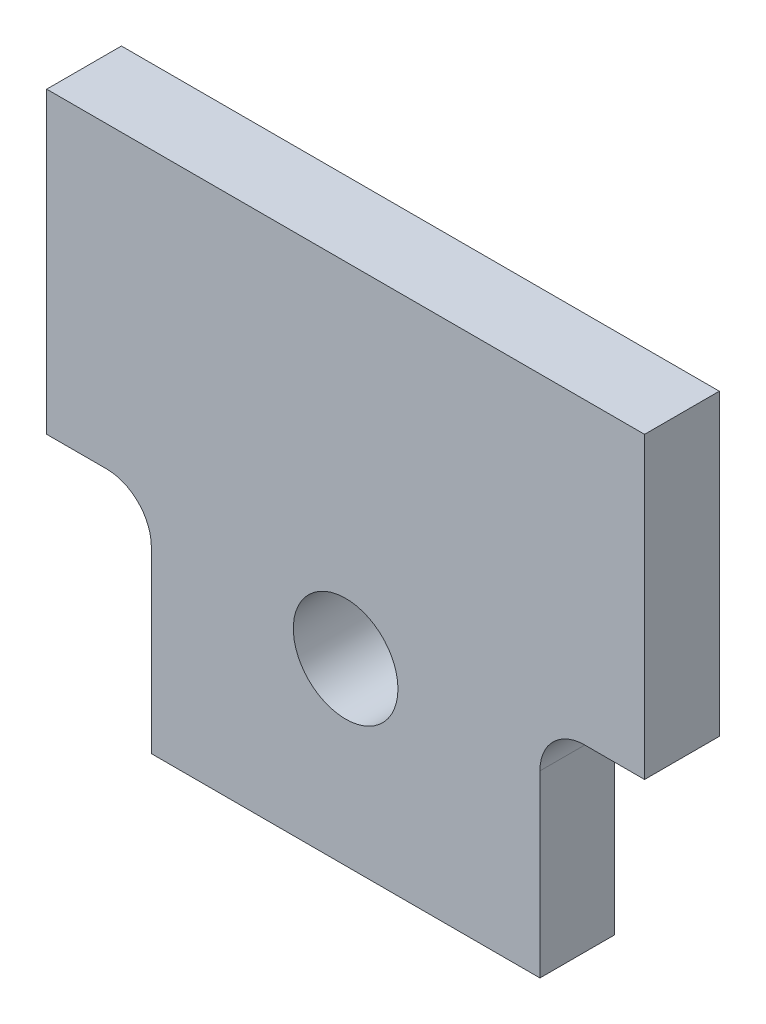
ISO-10303-21;
HEADER;
FILE_DESCRIPTION(('STEP AP214'),'2;1');
FILE_NAME('part.step','',(''),(''),'','','');
FILE_SCHEMA(('AUTOMOTIVE_DESIGN { 1 0 10303 214 1 1 1 1 }'));
ENDSEC;
DATA;
#1=APPLICATION_CONTEXT('core data for automotive mechanical design processes');
#2=APPLICATION_PROTOCOL_DEFINITION('international standard','automotive_design',2000,#1);
#3=PRODUCT_CONTEXT('',#1,'mechanical');
#4=PRODUCT('Part','Part','',(#3));
#5=PRODUCT_RELATED_PRODUCT_CATEGORY('part','',(#4));
#6=PRODUCT_DEFINITION_FORMATION('','',#4);
#7=PRODUCT_DEFINITION_CONTEXT('part definition',#1,'design');
#8=PRODUCT_DEFINITION('design','',#6,#7);
#9=PRODUCT_DEFINITION_SHAPE('','',#8);
#10=(LENGTH_UNIT() NAMED_UNIT(*) SI_UNIT(.MILLI.,.METRE.));
#11=(NAMED_UNIT(*) PLANE_ANGLE_UNIT() SI_UNIT($,.RADIAN.));
#12=(NAMED_UNIT(*) SI_UNIT($,.STERADIAN.) SOLID_ANGLE_UNIT());
#13=UNCERTAINTY_MEASURE_WITH_UNIT(LENGTH_MEASURE(1.E-05),#10,'distance_accuracy_value','');
#14=(GEOMETRIC_REPRESENTATION_CONTEXT(3) GLOBAL_UNCERTAINTY_ASSIGNED_CONTEXT((#13)) GLOBAL_UNIT_ASSIGNED_CONTEXT((#10,
#11,#12)) REPRESENTATION_CONTEXT('',''));
#15=CARTESIAN_POINT('',(0.,0.,0.));
#16=DIRECTION('',(0.,0.,1.));
#17=DIRECTION('',(1.,0.,0.));
#18=AXIS2_PLACEMENT_3D('',#15,#16,#17);
#19=CARTESIAN_POINT('',(-1250.,-390.,19.9963663896532));
#20=DIRECTION('',(-1.,0.,0.));
#21=DIRECTION('',(0.,0.,1.));
#22=AXIS2_PLACEMENT_3D('',#19,#20,#21);
#23=PLANE('',#22);
#24=DIRECTION('',(0.,1.,0.));
#25=VECTOR('',#24,1.);
#26=CARTESIAN_POINT('',(-1250.,-390.,19.9963663896532));
#27=LINE('',#26,#25);
#28=CARTESIAN_POINT('',(-1250.,-375.,19.9963663896576));
#29=VERTEX_POINT('',#28);
#30=CARTESIAN_POINT('',(-1250.,-355.,19.9963663896534));
#31=VERTEX_POINT('',#30);
#32=EDGE_CURVE('E136',#29,#31,#27,.T.);
#33=ORIENTED_EDGE('',*,*,#32,.F.);
#34=DIRECTION('',(0.,0.,1.));
#35=VECTOR('',#34,1.);
#36=CARTESIAN_POINT('',(-1250.,-375.,-20.0036336103399));
#37=LINE('',#36,#35);
#38=CARTESIAN_POINT('',(-1250.,-375.,14.9963663896531));
#39=VERTEX_POINT('',#38);
#40=EDGE_CURVE('E119',#39,#29,#37,.T.);
#41=ORIENTED_EDGE('',*,*,#40,.F.);
#42=DIRECTION('',(0.,1.,0.));
#43=VECTOR('',#42,1.);
#44=CARTESIAN_POINT('',(-1250.,-390.,14.9963663896531));
#45=LINE('',#44,#43);
#46=CARTESIAN_POINT('',(-1250.,-355.,14.9963663896531));
#47=VERTEX_POINT('',#46);
#48=EDGE_CURVE('E196',#39,#47,#45,.T.);
#49=ORIENTED_EDGE('',*,*,#48,.T.);
#50=DIRECTION('',(0.,0.,1.));
#51=VECTOR('',#50,1.);
#52=CARTESIAN_POINT('',(-1250.,-355.,19.9963663896534));
#53=LINE('',#52,#51);
#54=EDGE_CURVE('E144',#47,#31,#53,.T.);
#55=ORIENTED_EDGE('',*,*,#54,.T.);
#56=EDGE_LOOP('',(#33,#41,#49,#55));
#57=FACE_BOUND('',#56,.T.);
#58=ADVANCED_FACE('F42',(#57),#23,.F.);
#59=CARTESIAN_POINT('',(-1250.,-390.,19.9963663896532));
#60=DIRECTION('',(0.,0.,-1.));
#61=DIRECTION('',(-1.,0.,0.));
#62=AXIS2_PLACEMENT_3D('',#59,#60,#61);
#63=PLANE('',#62);
#64=CARTESIAN_POINT('',(-1270.,-378.,19.9963663896575));
#65=DIRECTION('',(0.,0.,1.));
#66=DIRECTION('',(1.,0.,0.));
#67=AXIS2_PLACEMENT_3D('',#64,#65,#66);
#68=CIRCLE('',#67,3.50000000000006);
#69=CARTESIAN_POINT('',(-1266.5,-378.,19.9963663896575));
#70=VERTEX_POINT('',#69);
#71=EDGE_CURVE('E213',#70,#70,#68,.T.);
#72=ORIENTED_EDGE('',*,*,#71,.F.);
#73=EDGE_LOOP('',(#72));
#74=FACE_BOUND('',#73,.T.);
#75=DIRECTION('',(-1.,0.,0.));
#76=VECTOR('',#75,1.);
#77=CARTESIAN_POINT('',(-1250.,-390.,19.9963663896532));
#78=LINE('',#77,#76);
#79=CARTESIAN_POINT('',(-1257.,-390.,19.9963663896531));
#80=VERTEX_POINT('',#79);
#81=CARTESIAN_POINT('',(-1283.,-390.,19.9963663896574));
#82=VERTEX_POINT('',#81);
#83=EDGE_CURVE('E225',#80,#82,#78,.T.);
#84=ORIENTED_EDGE('',*,*,#83,.F.);
#85=DIRECTION('',(0.,-1.,0.));
#86=VECTOR('',#85,1.);
#87=CARTESIAN_POINT('',(-1257.,-390.,19.9963663896576));
#88=LINE('',#87,#86);
#89=CARTESIAN_POINT('',(-1257.,-378.,19.9963663896576));
#90=VERTEX_POINT('',#89);
#91=EDGE_CURVE('E131',#90,#80,#88,.T.);
#92=ORIENTED_EDGE('',*,*,#91,.F.);
#93=CARTESIAN_POINT('',(-1254.,-378.,19.996366389653));
#94=DIRECTION('',(0.,0.,-1.));
#95=DIRECTION('',(-1.,0.,0.));
#96=AXIS2_PLACEMENT_3D('',#93,#94,#95);
#97=CIRCLE('',#96,3.);
#98=CARTESIAN_POINT('',(-1254.,-375.,19.9963663896576));
#99=VERTEX_POINT('',#98);
#100=EDGE_CURVE('E139',#90,#99,#97,.T.);
#101=ORIENTED_EDGE('',*,*,#100,.T.);
#102=DIRECTION('',(-1.,0.,0.));
#103=VECTOR('',#102,1.);
#104=CARTESIAN_POINT('',(-1250.,-375.,19.9963663896576));
#105=LINE('',#104,#103);
#106=EDGE_CURVE('E122',#29,#99,#105,.T.);
#107=ORIENTED_EDGE('',*,*,#106,.F.);
#108=ORIENTED_EDGE('',*,*,#32,.T.);
#109=DIRECTION('',(-1.,0.,0.));
#110=VECTOR('',#109,1.);
#111=CARTESIAN_POINT('',(-1250.,-355.,19.9963663896534));
#112=LINE('',#111,#110);
#113=CARTESIAN_POINT('',(-1290.,-355.,19.996366389653));
#114=VERTEX_POINT('',#113);
#115=EDGE_CURVE('E208',#31,#114,#112,.T.);
#116=ORIENTED_EDGE('',*,*,#115,.T.);
#117=DIRECTION('',(0.,1.,0.));
#118=VECTOR('',#117,1.);
#119=CARTESIAN_POINT('',(-1290.,-390.,19.9963663896531));
#120=LINE('',#119,#118);
#121=CARTESIAN_POINT('',(-1290.,-375.,19.9963663896574));
#122=VERTEX_POINT('',#121);
#123=EDGE_CURVE('E147',#122,#114,#120,.T.);
#124=ORIENTED_EDGE('',*,*,#123,.F.);
#125=DIRECTION('',(-1.,0.,0.));
#126=VECTOR('',#125,1.);
#127=CARTESIAN_POINT('',(-1290.,-375.,19.9963663896574));
#128=LINE('',#127,#126);
#129=CARTESIAN_POINT('',(-1286.,-375.,19.9963663896574));
#130=VERTEX_POINT('',#129);
#131=EDGE_CURVE('E188',#130,#122,#128,.T.);
#132=ORIENTED_EDGE('',*,*,#131,.F.);
#133=CARTESIAN_POINT('',(-1286.,-378.,19.996366389653));
#134=DIRECTION('',(0.,0.,-1.));
#135=DIRECTION('',(-1.,0.,0.));
#136=AXIS2_PLACEMENT_3D('',#133,#134,#135);
#137=CIRCLE('',#136,3.);
#138=CARTESIAN_POINT('',(-1283.,-378.,19.9963663896574));
#139=VERTEX_POINT('',#138);
#140=EDGE_CURVE('E51',#130,#139,#137,.T.);
#141=ORIENTED_EDGE('',*,*,#140,.T.);
#142=DIRECTION('',(0.,1.,0.));
#143=VECTOR('',#142,1.);
#144=CARTESIAN_POINT('',(-1283.,-390.,19.9963663896574));
#145=LINE('',#144,#143);
#146=EDGE_CURVE('E190',#82,#139,#145,.T.);
#147=ORIENTED_EDGE('',*,*,#146,.F.);
#148=EDGE_LOOP('',(#84,#92,#101,#107,#108,#116,#124,#132,#141,#147));
#149=FACE_BOUND('',#148,.T.);
#150=ADVANCED_FACE('F134',(#74,#149),#63,.F.);
#151=CARTESIAN_POINT('',(-1290.,-390.,14.9963663896529));
#152=DIRECTION('',(1.,0.,0.));
#153=DIRECTION('',(0.,0.,-1.));
#154=AXIS2_PLACEMENT_3D('',#151,#152,#153);
#155=PLANE('',#154);
#156=DIRECTION('',(0.,1.,0.));
#157=VECTOR('',#156,1.);
#158=CARTESIAN_POINT('',(-1290.,-390.,14.9963663896529));
#159=LINE('',#158,#157);
#160=CARTESIAN_POINT('',(-1290.,-375.,14.9963663896529));
#161=VERTEX_POINT('',#160);
#162=CARTESIAN_POINT('',(-1290.,-355.,14.9963663896529));
#163=VERTEX_POINT('',#162);
#164=EDGE_CURVE('E155',#161,#163,#159,.T.);
#165=ORIENTED_EDGE('',*,*,#164,.F.);
#166=DIRECTION('',(0.,0.,1.));
#167=VECTOR('',#166,1.);
#168=CARTESIAN_POINT('',(-1290.,-375.,-20.00363361034));
#169=LINE('',#168,#167);
#170=EDGE_CURVE('E197',#161,#122,#169,.T.);
#171=ORIENTED_EDGE('',*,*,#170,.T.);
#172=ORIENTED_EDGE('',*,*,#123,.T.);
#173=DIRECTION('',(0.,0.,-1.));
#174=VECTOR('',#173,1.);
#175=CARTESIAN_POINT('',(-1290.,-355.,14.9963663896529));
#176=LINE('',#175,#174);
#177=EDGE_CURVE('E203',#114,#163,#176,.T.);
#178=ORIENTED_EDGE('',*,*,#177,.T.);
#179=EDGE_LOOP('',(#165,#171,#172,#178));
#180=FACE_BOUND('',#179,.T.);
#181=ADVANCED_FACE('F275',(#180),#155,.F.);
#182=CARTESIAN_POINT('',(-1250.,-390.,14.9963663896531));
#183=DIRECTION('',(0.,0.,1.));
#184=DIRECTION('',(1.,0.,0.));
#185=AXIS2_PLACEMENT_3D('',#182,#183,#184);
#186=PLANE('',#185);
#187=CARTESIAN_POINT('',(-1270.,-378.,14.9963663896528));
#188=DIRECTION('',(0.,0.,1.));
#189=DIRECTION('',(1.,0.,0.));
#190=AXIS2_PLACEMENT_3D('',#187,#188,#189);
#191=CIRCLE('',#190,3.50000000000006);
#192=CARTESIAN_POINT('',(-1266.5,-378.,14.9963663896528));
#193=VERTEX_POINT('',#192);
#194=EDGE_CURVE('E210',#193,#193,#191,.T.);
#195=ORIENTED_EDGE('',*,*,#194,.T.);
#196=EDGE_LOOP('',(#195));
#197=FACE_BOUND('',#196,.T.);
#198=DIRECTION('',(-1.,0.,0.));
#199=VECTOR('',#198,1.);
#200=CARTESIAN_POINT('',(-1250.,-375.,14.9963663896531));
#201=LINE('',#200,#199);
#202=CARTESIAN_POINT('',(-1254.,-375.,14.9963663896529));
#203=VERTEX_POINT('',#202);
#204=EDGE_CURVE('E125',#39,#203,#201,.T.);
#205=ORIENTED_EDGE('',*,*,#204,.T.);
#206=CARTESIAN_POINT('',(-1254.,-378.,14.9963663896532));
#207=DIRECTION('',(0.,0.,1.));
#208=DIRECTION('',(1.,0.,0.));
#209=AXIS2_PLACEMENT_3D('',#206,#207,#208);
#210=CIRCLE('',#209,3.);
#211=CARTESIAN_POINT('',(-1257.,-378.,14.996366389653));
#212=VERTEX_POINT('',#211);
#213=EDGE_CURVE('E182',#203,#212,#210,.T.);
#214=ORIENTED_EDGE('',*,*,#213,.T.);
#215=DIRECTION('',(0.,-1.,0.));
#216=VECTOR('',#215,1.);
#217=CARTESIAN_POINT('',(-1257.,-390.,14.996366389653));
#218=LINE('',#217,#216);
#219=CARTESIAN_POINT('',(-1257.,-390.,14.996366389653));
#220=VERTEX_POINT('',#219);
#221=EDGE_CURVE('E130',#212,#220,#218,.T.);
#222=ORIENTED_EDGE('',*,*,#221,.T.);
#223=DIRECTION('',(1.,0.,0.));
#224=VECTOR('',#223,1.);
#225=CARTESIAN_POINT('',(-1250.,-390.,14.9963663896531));
#226=LINE('',#225,#224);
#227=CARTESIAN_POINT('',(-1283.,-390.,14.9963663896526));
#228=VERTEX_POINT('',#227);
#229=EDGE_CURVE('E221',#228,#220,#226,.T.);
#230=ORIENTED_EDGE('',*,*,#229,.F.);
#231=DIRECTION('',(0.,1.,0.));
#232=VECTOR('',#231,1.);
#233=CARTESIAN_POINT('',(-1283.,-390.,14.9963663896526));
#234=LINE('',#233,#232);
#235=CARTESIAN_POINT('',(-1283.,-378.,14.9963663896529));
#236=VERTEX_POINT('',#235);
#237=EDGE_CURVE('E201',#228,#236,#234,.T.);
#238=ORIENTED_EDGE('',*,*,#237,.T.);
#239=CARTESIAN_POINT('',(-1286.,-378.,14.9963663896528));
#240=DIRECTION('',(0.,0.,1.));
#241=DIRECTION('',(1.,0.,0.));
#242=AXIS2_PLACEMENT_3D('',#239,#240,#241);
#243=CIRCLE('',#242,3.);
#244=CARTESIAN_POINT('',(-1286.,-375.,14.9963663896532));
#245=VERTEX_POINT('',#244);
#246=EDGE_CURVE('E11',#236,#245,#243,.T.);
#247=ORIENTED_EDGE('',*,*,#246,.T.);
#248=DIRECTION('',(-1.,0.,0.));
#249=VECTOR('',#248,1.);
#250=CARTESIAN_POINT('',(-1250.,-375.,14.9963663896531));
#251=LINE('',#250,#249);
#252=EDGE_CURVE('E152',#245,#161,#251,.T.);
#253=ORIENTED_EDGE('',*,*,#252,.T.);
#254=ORIENTED_EDGE('',*,*,#164,.T.);
#255=DIRECTION('',(1.,0.,0.));
#256=VECTOR('',#255,1.);
#257=CARTESIAN_POINT('',(-1250.,-355.,14.9963663896531));
#258=LINE('',#257,#256);
#259=EDGE_CURVE('E207',#163,#47,#258,.T.);
#260=ORIENTED_EDGE('',*,*,#259,.T.);
#261=ORIENTED_EDGE('',*,*,#48,.F.);
#262=EDGE_LOOP('',(#205,#214,#222,#230,#238,#247,#253,#254,#260,#261));
#263=FACE_BOUND('',#262,.T.);
#264=ADVANCED_FACE('F250',(#197,#263),#186,.F.);
#265=CARTESIAN_POINT('',(0.,-390.,0.));
#266=DIRECTION('',(0.,1.,0.));
#267=DIRECTION('',(0.,0.,1.));
#268=AXIS2_PLACEMENT_3D('',#265,#266,#267);
#269=PLANE('',#268);
#270=ORIENTED_EDGE('',*,*,#229,.T.);
#271=DIRECTION('',(0.,0.,1.));
#272=VECTOR('',#271,1.);
#273=CARTESIAN_POINT('',(-1257.,-390.,0.));
#274=LINE('',#273,#272);
#275=EDGE_CURVE('E161',#220,#80,#274,.T.);
#276=ORIENTED_EDGE('',*,*,#275,.T.);
#277=ORIENTED_EDGE('',*,*,#83,.T.);
#278=DIRECTION('',(0.,0.,-1.));
#279=VECTOR('',#278,1.);
#280=CARTESIAN_POINT('',(-1283.,-390.,0.));
#281=LINE('',#280,#279);
#282=EDGE_CURVE('E146',#82,#228,#281,.T.);
#283=ORIENTED_EDGE('',*,*,#282,.T.);
#284=EDGE_LOOP('',(#270,#276,#277,#283));
#285=FACE_BOUND('',#284,.T.);
#286=ADVANCED_FACE('F287',(#285),#269,.F.);
#287=CARTESIAN_POINT('',(-1.11022302462516E-13,-355.,0.));
#288=DIRECTION('',(0.,1.,0.));
#289=DIRECTION('',(0.,0.,1.));
#290=AXIS2_PLACEMENT_3D('',#287,#288,#289);
#291=PLANE('',#290);
#292=ORIENTED_EDGE('',*,*,#54,.F.);
#293=ORIENTED_EDGE('',*,*,#259,.F.);
#294=ORIENTED_EDGE('',*,*,#177,.F.);
#295=ORIENTED_EDGE('',*,*,#115,.F.);
#296=EDGE_LOOP('',(#292,#293,#294,#295));
#297=FACE_BOUND('',#296,.T.);
#298=ADVANCED_FACE('F272',(#297),#291,.T.);
#299=CARTESIAN_POINT('',(-1270.,-378.,19.9963663896575));
#300=DIRECTION('',(0.,0.,1.));
#301=DIRECTION('',(1.,0.,0.));
#302=AXIS2_PLACEMENT_3D('',#299,#300,#301);
#303=CYLINDRICAL_SURFACE('',#302,3.50000000000006);
#304=ORIENTED_EDGE('',*,*,#71,.T.);
#305=EDGE_LOOP('',(#304));
#306=FACE_BOUND('',#305,.T.);
#307=ORIENTED_EDGE('',*,*,#194,.F.);
#308=EDGE_LOOP('',(#307));
#309=FACE_BOUND('',#308,.T.);
#310=ADVANCED_FACE('F294',(#306,#309),#303,.F.);
#311=CARTESIAN_POINT('',(-1290.,-375.,-20.00363361034));
#312=DIRECTION('',(0.,1.,0.));
#313=DIRECTION('',(0.,0.,1.));
#314=AXIS2_PLACEMENT_3D('',#311,#312,#313);
#315=PLANE('',#314);
#316=ORIENTED_EDGE('',*,*,#252,.F.);
#317=DIRECTION('',(0.,0.,1.));
#318=VECTOR('',#317,1.);
#319=CARTESIAN_POINT('',(-1286.,-375.,19.9963663896574));
#320=LINE('',#319,#318);
#321=EDGE_CURVE('E174',#245,#130,#320,.T.);
#322=ORIENTED_EDGE('',*,*,#321,.T.);
#323=ORIENTED_EDGE('',*,*,#131,.T.);
#324=ORIENTED_EDGE('',*,*,#170,.F.);
#325=EDGE_LOOP('',(#316,#322,#323,#324));
#326=FACE_BOUND('',#325,.T.);
#327=ADVANCED_FACE('F279',(#326),#315,.F.);
#328=CARTESIAN_POINT('',(-1283.,-390.,-20.00363361034));
#329=DIRECTION('',(1.,0.,0.));
#330=DIRECTION('',(0.,0.,-1.));
#331=AXIS2_PLACEMENT_3D('',#328,#329,#330);
#332=PLANE('',#331);
#333=ORIENTED_EDGE('',*,*,#146,.T.);
#334=DIRECTION('',(0.,0.,1.));
#335=VECTOR('',#334,1.);
#336=CARTESIAN_POINT('',(-1283.,-378.,14.9963663896529));
#337=LINE('',#336,#335);
#338=EDGE_CURVE('E58',#139,#236,#337,.F.);
#339=ORIENTED_EDGE('',*,*,#338,.T.);
#340=ORIENTED_EDGE('',*,*,#237,.F.);
#341=ORIENTED_EDGE('',*,*,#282,.F.);
#342=EDGE_LOOP('',(#333,#339,#340,#341));
#343=FACE_BOUND('',#342,.T.);
#344=ADVANCED_FACE('F285',(#343),#332,.F.);
#345=CARTESIAN_POINT('',(-1250.,-375.,-20.0036336103399));
#346=DIRECTION('',(0.,1.,0.));
#347=DIRECTION('',(0.,0.,1.));
#348=AXIS2_PLACEMENT_3D('',#345,#346,#347);
#349=PLANE('',#348);
#350=ORIENTED_EDGE('',*,*,#106,.T.);
#351=DIRECTION('',(0.,0.,1.));
#352=VECTOR('',#351,1.);
#353=CARTESIAN_POINT('',(-1254.,-375.,14.9963663896529));
#354=LINE('',#353,#352);
#355=EDGE_CURVE('E171',#99,#203,#354,.F.);
#356=ORIENTED_EDGE('',*,*,#355,.T.);
#357=ORIENTED_EDGE('',*,*,#204,.F.);
#358=ORIENTED_EDGE('',*,*,#40,.T.);
#359=EDGE_LOOP('',(#350,#356,#357,#358));
#360=FACE_BOUND('',#359,.T.);
#361=ADVANCED_FACE('F121',(#360),#349,.F.);
#362=CARTESIAN_POINT('',(-1257.,-390.,-20.0036336103399));
#363=DIRECTION('',(-1.,0.,0.));
#364=DIRECTION('',(0.,0.,1.));
#365=AXIS2_PLACEMENT_3D('',#362,#363,#364);
#366=PLANE('',#365);
#367=ORIENTED_EDGE('',*,*,#221,.F.);
#368=DIRECTION('',(0.,0.,1.));
#369=VECTOR('',#368,1.);
#370=CARTESIAN_POINT('',(-1257.,-378.,19.9963663896576));
#371=LINE('',#370,#369);
#372=EDGE_CURVE('E167',#212,#90,#371,.T.);
#373=ORIENTED_EDGE('',*,*,#372,.T.);
#374=ORIENTED_EDGE('',*,*,#91,.T.);
#375=ORIENTED_EDGE('',*,*,#275,.F.);
#376=EDGE_LOOP('',(#367,#373,#374,#375));
#377=FACE_BOUND('',#376,.T.);
#378=ADVANCED_FACE('F257',(#377),#366,.F.);
#379=CARTESIAN_POINT('',(-1254.,-378.,-20.00363361034));
#380=DIRECTION('',(0.,0.,-1.));
#381=DIRECTION('',(-1.,0.,0.));
#382=AXIS2_PLACEMENT_3D('',#379,#380,#381);
#383=CYLINDRICAL_SURFACE('',#382,3.);
#384=ORIENTED_EDGE('',*,*,#213,.F.);
#385=ORIENTED_EDGE('',*,*,#355,.F.);
#386=ORIENTED_EDGE('',*,*,#100,.F.);
#387=ORIENTED_EDGE('',*,*,#372,.F.);
#388=EDGE_LOOP('',(#384,#385,#386,#387));
#389=FACE_BOUND('',#388,.T.);
#390=ADVANCED_FACE('F255',(#389),#383,.F.);
#391=CARTESIAN_POINT('',(-1286.,-378.,-20.0036336103398));
#392=DIRECTION('',(0.,0.,-1.));
#393=DIRECTION('',(-1.,0.,0.));
#394=AXIS2_PLACEMENT_3D('',#391,#392,#393);
#395=CYLINDRICAL_SURFACE('',#394,3.);
#396=ORIENTED_EDGE('',*,*,#246,.F.);
#397=ORIENTED_EDGE('',*,*,#338,.F.);
#398=ORIENTED_EDGE('',*,*,#140,.F.);
#399=ORIENTED_EDGE('',*,*,#321,.F.);
#400=EDGE_LOOP('',(#396,#397,#398,#399));
#401=FACE_BOUND('',#400,.T.);
#402=ADVANCED_FACE('F44',(#401),#395,.F.);
#403=CLOSED_SHELL('',(#58,#150,#181,#264,#286,#298,#310,#327,#344,#361,#378,#390,#402));
#404=MANIFOLD_SOLID_BREP('B2',#403);
#405=ADVANCED_BREP_SHAPE_REPRESENTATION('',(#18,#404),#14);
#406=SHAPE_DEFINITION_REPRESENTATION(#9,#405);
ENDSEC;
END-ISO-10303-21;
